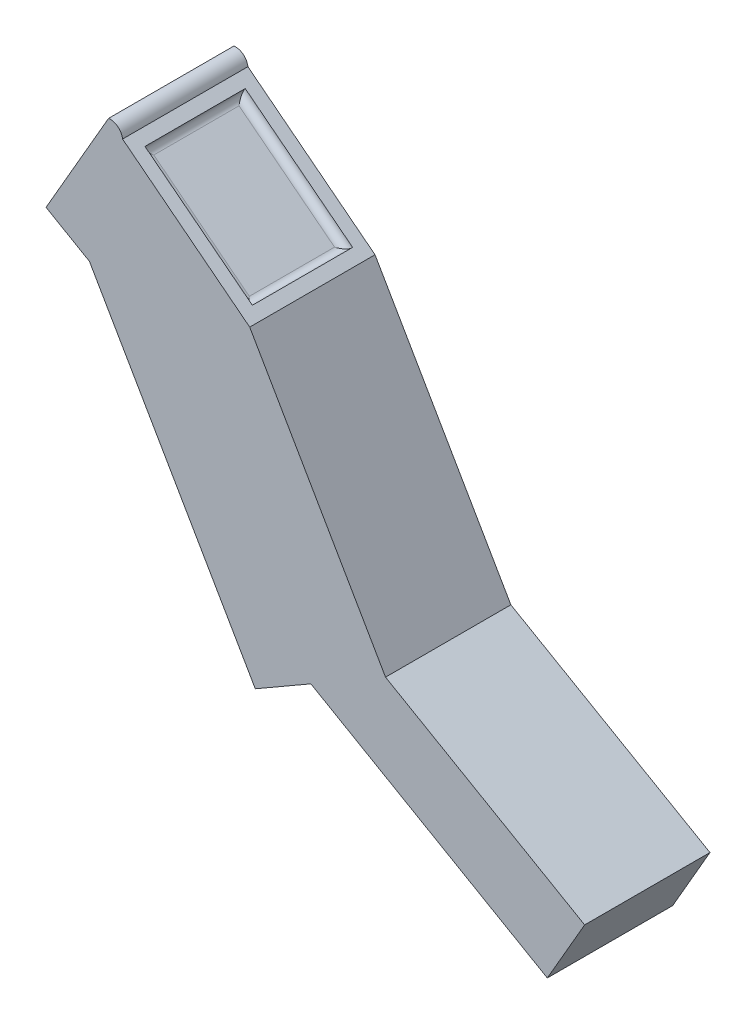
ISO-10303-21;
HEADER;
FILE_DESCRIPTION(('STEP AP214'),'2;1');
FILE_NAME('part.step','',(''),(''),'','','');
FILE_SCHEMA(('AUTOMOTIVE_DESIGN { 1 0 10303 214 1 1 1 1 }'));
ENDSEC;
DATA;
#1=APPLICATION_CONTEXT('core data for automotive mechanical design processes');
#2=APPLICATION_PROTOCOL_DEFINITION('international standard','automotive_design',2000,#1);
#3=PRODUCT_CONTEXT('',#1,'mechanical');
#4=PRODUCT('Part','Part','',(#3));
#5=PRODUCT_RELATED_PRODUCT_CATEGORY('part','',(#4));
#6=PRODUCT_DEFINITION_FORMATION('','',#4);
#7=PRODUCT_DEFINITION_CONTEXT('part definition',#1,'design');
#8=PRODUCT_DEFINITION('design','',#6,#7);
#9=PRODUCT_DEFINITION_SHAPE('','',#8);
#10=(LENGTH_UNIT() NAMED_UNIT(*) SI_UNIT(.MILLI.,.METRE.));
#11=(NAMED_UNIT(*) PLANE_ANGLE_UNIT() SI_UNIT($,.RADIAN.));
#12=(NAMED_UNIT(*) SI_UNIT($,.STERADIAN.) SOLID_ANGLE_UNIT());
#13=UNCERTAINTY_MEASURE_WITH_UNIT(LENGTH_MEASURE(1.E-05),#10,'distance_accuracy_value','');
#14=(GEOMETRIC_REPRESENTATION_CONTEXT(3) GLOBAL_UNCERTAINTY_ASSIGNED_CONTEXT((#13)) GLOBAL_UNIT_ASSIGNED_CONTEXT((#10,
#11,#12)) REPRESENTATION_CONTEXT('',''));
#15=CARTESIAN_POINT('',(0.,0.,0.));
#16=DIRECTION('',(0.,0.,1.));
#17=DIRECTION('',(1.,0.,0.));
#18=AXIS2_PLACEMENT_3D('',#15,#16,#17);
#19=CARTESIAN_POINT('',(-3.57058150505291,1.62403683269044,5.));
#20=DIRECTION('',(0.,0.,-1.));
#21=DIRECTION('',(-1.,0.,0.));
#22=AXIS2_PLACEMENT_3D('',#19,#20,#21);
#23=CYLINDRICAL_SURFACE('',#22,0.500787582760858);
#24=CARTESIAN_POINT('',(-3.57058150505291,1.62403683269044,0.));
#25=DIRECTION('',(0.,0.,1.));
#26=DIRECTION('',(-1.,0.,0.));
#27=AXIS2_PLACEMENT_3D('',#24,#25,#26);
#28=CIRCLE('',#27,0.500787582760858);
#29=CARTESIAN_POINT('',(-3.07354024797554,1.68517758677815,0.));
#30=VERTEX_POINT('',#29);
#31=CARTESIAN_POINT('',(-3.63172225914062,2.1210780897678,0.));
#32=VERTEX_POINT('',#31);
#33=EDGE_CURVE('E183',#30,#32,#28,.T.);
#34=ORIENTED_EDGE('',*,*,#33,.T.);
#35=DIRECTION('',(0.,0.,-1.));
#36=VECTOR('',#35,1.);
#37=CARTESIAN_POINT('',(-3.63172225914062,2.1210780897678,5.));
#38=LINE('',#37,#36);
#39=CARTESIAN_POINT('',(-3.63172225914062,2.1210780897678,5.));
#40=VERTEX_POINT('',#39);
#41=EDGE_CURVE('E250',#40,#32,#38,.T.);
#42=ORIENTED_EDGE('',*,*,#41,.F.);
#43=CARTESIAN_POINT('',(-3.57058150505291,1.62403683269044,5.));
#44=DIRECTION('',(0.,0.,1.));
#45=DIRECTION('',(-1.,0.,0.));
#46=AXIS2_PLACEMENT_3D('',#43,#44,#45);
#47=CIRCLE('',#46,0.500787582760858);
#48=CARTESIAN_POINT('',(-3.07354024797554,1.68517758677815,5.));
#49=VERTEX_POINT('',#48);
#50=EDGE_CURVE('E184',#49,#40,#47,.T.);
#51=ORIENTED_EDGE('',*,*,#50,.F.);
#52=DIRECTION('',(0.,0.,-1.));
#53=VECTOR('',#52,1.);
#54=CARTESIAN_POINT('',(-3.07354024797554,1.68517758677815,5.));
#55=LINE('',#54,#53);
#56=EDGE_CURVE('E222',#49,#30,#55,.T.);
#57=ORIENTED_EDGE('',*,*,#56,.T.);
#58=EDGE_LOOP('',(#34,#42,#51,#57));
#59=FACE_BOUND('',#58,.T.);
#60=ADVANCED_FACE('F34',(#59),#23,.T.);
#61=CARTESIAN_POINT('',(-6.12718022632611,-2.20118189755004,5.));
#62=DIRECTION('',(0.86602540378444,-0.499999999999998,0.));
#63=DIRECTION('',(0.499999999999998,0.86602540378444,0.));
#64=AXIS2_PLACEMENT_3D('',#61,#62,#63);
#65=PLANE('',#64);
#66=DIRECTION('',(-0.499999999999998,-0.86602540378444,0.));
#67=VECTOR('',#66,1.);
#68=CARTESIAN_POINT('',(-6.12718022632611,-2.20118189755004,0.));
#69=LINE('',#68,#67);
#70=CARTESIAN_POINT('',(-6.12718022632611,-2.20118189755004,0.));
#71=VERTEX_POINT('',#70);
#72=EDGE_CURVE('E229',#32,#71,#69,.T.);
#73=ORIENTED_EDGE('',*,*,#72,.T.);
#74=DIRECTION('',(0.,0.,-1.));
#75=VECTOR('',#74,1.);
#76=CARTESIAN_POINT('',(-6.12718022632611,-2.20118189755004,5.));
#77=LINE('',#76,#75);
#78=CARTESIAN_POINT('',(-6.12718022632611,-2.20118189755004,5.));
#79=VERTEX_POINT('',#78);
#80=EDGE_CURVE('E247',#79,#71,#77,.T.);
#81=ORIENTED_EDGE('',*,*,#80,.F.);
#82=DIRECTION('',(-0.499999999999998,-0.86602540378444,0.));
#83=VECTOR('',#82,1.);
#84=CARTESIAN_POINT('',(-6.12718022632611,-2.20118189755004,5.));
#85=LINE('',#84,#83);
#86=EDGE_CURVE('E187',#40,#79,#85,.T.);
#87=ORIENTED_EDGE('',*,*,#86,.F.);
#88=ORIENTED_EDGE('',*,*,#41,.T.);
#89=EDGE_LOOP('',(#73,#81,#87,#88));
#90=FACE_BOUND('',#89,.T.);
#91=ADVANCED_FACE('F292',(#90),#65,.F.);
#92=CARTESIAN_POINT('',(-4.39512941875723,-3.20118189755004,5.));
#93=DIRECTION('',(0.499999999999999,0.86602540378444,0.));
#94=DIRECTION('',(-0.86602540378444,0.499999999999999,0.));
#95=AXIS2_PLACEMENT_3D('',#92,#93,#94);
#96=PLANE('',#95);
#97=DIRECTION('',(0.86602540378444,-0.499999999999999,0.));
#98=VECTOR('',#97,1.);
#99=CARTESIAN_POINT('',(-4.39512941875723,-3.20118189755004,0.));
#100=LINE('',#99,#98);
#101=CARTESIAN_POINT('',(-4.39512941875723,-3.20118189755004,0.));
#102=VERTEX_POINT('',#101);
#103=EDGE_CURVE('E231',#71,#102,#100,.T.);
#104=ORIENTED_EDGE('',*,*,#103,.T.);
#105=DIRECTION('',(0.,0.,-1.));
#106=VECTOR('',#105,1.);
#107=CARTESIAN_POINT('',(-4.39512941875723,-3.20118189755004,5.));
#108=LINE('',#107,#106);
#109=CARTESIAN_POINT('',(-4.39512941875723,-3.20118189755004,5.));
#110=VERTEX_POINT('',#109);
#111=EDGE_CURVE('E244',#110,#102,#108,.T.);
#112=ORIENTED_EDGE('',*,*,#111,.F.);
#113=DIRECTION('',(0.86602540378444,-0.499999999999999,0.));
#114=VECTOR('',#113,1.);
#115=CARTESIAN_POINT('',(-4.39512941875723,-3.20118189755004,5.));
#116=LINE('',#115,#114);
#117=EDGE_CURVE('E190',#79,#110,#116,.T.);
#118=ORIENTED_EDGE('',*,*,#117,.F.);
#119=ORIENTED_EDGE('',*,*,#80,.T.);
#120=EDGE_LOOP('',(#104,#112,#118,#119));
#121=FACE_BOUND('',#120,.T.);
#122=ADVANCED_FACE('F298',(#121),#96,.F.);
#123=CARTESIAN_POINT('',(2.22192139124275,-14.6622500967348,5.));
#124=DIRECTION('',(0.866025403784439,0.499999999999999,0.));
#125=DIRECTION('',(-0.499999999999999,0.866025403784439,0.));
#126=AXIS2_PLACEMENT_3D('',#123,#124,#125);
#127=PLANE('',#126);
#128=DIRECTION('',(0.499999999999999,-0.866025403784439,0.));
#129=VECTOR('',#128,1.);
#130=CARTESIAN_POINT('',(2.22192139124275,-14.6622500967348,0.));
#131=LINE('',#130,#129);
#132=CARTESIAN_POINT('',(2.22192139124275,-14.6622500967348,0.));
#133=VERTEX_POINT('',#132);
#134=EDGE_CURVE('E233',#102,#133,#131,.T.);
#135=ORIENTED_EDGE('',*,*,#134,.T.);
#136=DIRECTION('',(0.,0.,-1.));
#137=VECTOR('',#136,1.);
#138=CARTESIAN_POINT('',(2.22192139124275,-14.6622500967348,5.));
#139=LINE('',#138,#137);
#140=CARTESIAN_POINT('',(2.22192139124275,-14.6622500967348,5.));
#141=VERTEX_POINT('',#140);
#142=EDGE_CURVE('E241',#141,#133,#139,.T.);
#143=ORIENTED_EDGE('',*,*,#142,.F.);
#144=DIRECTION('',(0.499999999999999,-0.866025403784439,0.));
#145=VECTOR('',#144,1.);
#146=CARTESIAN_POINT('',(2.22192139124275,-14.6622500967348,5.));
#147=LINE('',#146,#145);
#148=EDGE_CURVE('E192',#110,#141,#147,.T.);
#149=ORIENTED_EDGE('',*,*,#148,.F.);
#150=ORIENTED_EDGE('',*,*,#111,.T.);
#151=EDGE_LOOP('',(#135,#143,#149,#150));
#152=FACE_BOUND('',#151,.T.);
#153=ADVANCED_FACE('F388',(#152),#127,.F.);
#154=CARTESIAN_POINT('',(2.22192139124275,-14.6622500967348,5.));
#155=DIRECTION('',(-0.5,0.866025403784438,0.));
#156=DIRECTION('',(-0.866025403784438,-0.5,0.));
#157=AXIS2_PLACEMENT_3D('',#154,#155,#156);
#158=PLANE('',#157);
#159=DIRECTION('',(0.866025403784438,0.5,0.));
#160=VECTOR('',#159,1.);
#161=CARTESIAN_POINT('',(2.22192139124275,-14.6622500967348,0.));
#162=LINE('',#161,#160);
#163=CARTESIAN_POINT('',(4.43894642493093,-13.3822500967348,0.));
#164=VERTEX_POINT('',#163);
#165=EDGE_CURVE('E202',#133,#164,#162,.T.);
#166=ORIENTED_EDGE('',*,*,#165,.T.);
#167=DIRECTION('',(0.,0.,1.));
#168=VECTOR('',#167,1.);
#169=CARTESIAN_POINT('',(4.43894642493093,-13.3822500967348,-13.0642177387711));
#170=LINE('',#169,#168);
#171=CARTESIAN_POINT('',(4.43894642493093,-13.3822500967348,5.));
#172=VERTEX_POINT('',#171);
#173=EDGE_CURVE('E156',#164,#172,#170,.T.);
#174=ORIENTED_EDGE('',*,*,#173,.T.);
#175=DIRECTION('',(0.866025403784438,0.5,0.));
#176=VECTOR('',#175,1.);
#177=CARTESIAN_POINT('',(2.22192139124275,-14.6622500967348,5.));
#178=LINE('',#177,#176);
#179=EDGE_CURVE('E194',#141,#172,#178,.T.);
#180=ORIENTED_EDGE('',*,*,#179,.F.);
#181=ORIENTED_EDGE('',*,*,#142,.T.);
#182=EDGE_LOOP('',(#166,#174,#180,#181));
#183=FACE_BOUND('',#182,.T.);
#184=ADVANCED_FACE('F393',(#183),#158,.F.);
#185=CARTESIAN_POINT('',(1.99897594712462,-2.27609726020619,5.));
#186=DIRECTION('',(-0.866025403784438,-0.5,0.));
#187=DIRECTION('',(0.5,-0.866025403784438,0.));
#188=AXIS2_PLACEMENT_3D('',#185,#186,#187);
#189=PLANE('',#188);
#190=DIRECTION('',(-0.5,0.866025403784438,0.));
#191=VECTOR('',#190,1.);
#192=CARTESIAN_POINT('',(1.99897594712462,-2.27609726020619,0.));
#193=LINE('',#192,#191);
#194=CARTESIAN_POINT('',(7.4180738139494,-11.6622500967348,0.));
#195=VERTEX_POINT('',#194);
#196=CARTESIAN_POINT('',(1.99897594712462,-2.27609726020619,0.));
#197=VERTEX_POINT('',#196);
#198=EDGE_CURVE('E236',#195,#197,#193,.T.);
#199=ORIENTED_EDGE('',*,*,#198,.T.);
#200=DIRECTION('',(0.,0.,-1.));
#201=VECTOR('',#200,1.);
#202=CARTESIAN_POINT('',(1.99897594712462,-2.27609726020619,5.));
#203=LINE('',#202,#201);
#204=CARTESIAN_POINT('',(1.99897594712462,-2.27609726020619,5.));
#205=VERTEX_POINT('',#204);
#206=EDGE_CURVE('E219',#205,#197,#203,.T.);
#207=ORIENTED_EDGE('',*,*,#206,.F.);
#208=DIRECTION('',(-0.499999999999999,0.866025403784439,0.));
#209=VECTOR('',#208,1.);
#210=CARTESIAN_POINT('',(6.28837327212462,-9.70555136095622,5.));
#211=LINE('',#210,#209);
#212=CARTESIAN_POINT('',(7.4180738139494,-11.6622500967348,5.));
#213=VERTEX_POINT('',#212);
#214=EDGE_CURVE('E197',#213,#205,#211,.T.);
#215=ORIENTED_EDGE('',*,*,#214,.F.);
#216=DIRECTION('',(0.,0.,-1.));
#217=VECTOR('',#216,1.);
#218=CARTESIAN_POINT('',(7.4180738139494,-11.6622500967348,5.));
#219=LINE('',#218,#217);
#220=EDGE_CURVE('E212',#213,#195,#219,.T.);
#221=ORIENTED_EDGE('',*,*,#220,.T.);
#222=EDGE_LOOP('',(#199,#207,#215,#221));
#223=FACE_BOUND('',#222,.T.);
#224=ADVANCED_FACE('F217',(#223),#189,.F.);
#225=CARTESIAN_POINT('',(1.99897594712462,-2.27609726020619,5.));
#226=DIRECTION('',(-0.615486909414452,-0.788147108311289,0.));
#227=DIRECTION('',(0.788147108311289,-0.615486909414452,0.));
#228=AXIS2_PLACEMENT_3D('',#225,#226,#227);
#229=PLANE('',#228);
#230=DIRECTION('',(0.,0.,-1.));
#231=VECTOR('',#230,1.);
#232=CARTESIAN_POINT('',(1.60490239296898,-1.96835380549897,4.5));
#233=LINE('',#232,#231);
#234=CARTESIAN_POINT('',(1.60490239296898,-1.96835380549897,4.5));
#235=VERTEX_POINT('',#234);
#236=CARTESIAN_POINT('',(1.60490239296898,-1.96835380549897,0.5));
#237=VERTEX_POINT('',#236);
#238=EDGE_CURVE('E173',#235,#237,#233,.T.);
#239=ORIENTED_EDGE('',*,*,#238,.F.);
#240=DIRECTION('',(0.788147108311289,-0.615486909414452,0.));
#241=VECTOR('',#240,1.);
#242=CARTESIAN_POINT('',(-2.6794666938199,1.37743413207092,4.5));
#243=LINE('',#242,#241);
#244=CARTESIAN_POINT('',(-2.6794666938199,1.37743413207092,4.5));
#245=VERTEX_POINT('',#244);
#246=EDGE_CURVE('E170',#245,#235,#243,.T.);
#247=ORIENTED_EDGE('',*,*,#246,.F.);
#248=DIRECTION('',(0.,0.,1.));
#249=VECTOR('',#248,1.);
#250=CARTESIAN_POINT('',(-2.6794666938199,1.37743413207092,0.500000000000001));
#251=LINE('',#250,#249);
#252=CARTESIAN_POINT('',(-2.6794666938199,1.37743413207092,0.500000000000001));
#253=VERTEX_POINT('',#252);
#254=EDGE_CURVE('E180',#253,#245,#251,.T.);
#255=ORIENTED_EDGE('',*,*,#254,.F.);
#256=DIRECTION('',(-0.788147108311289,0.615486909414452,0.));
#257=VECTOR('',#256,1.);
#258=CARTESIAN_POINT('',(1.60490239296898,-1.96835380549897,0.5));
#259=LINE('',#258,#257);
#260=EDGE_CURVE('E177',#237,#253,#259,.T.);
#261=ORIENTED_EDGE('',*,*,#260,.F.);
#262=EDGE_LOOP('',(#239,#247,#255,#261));
#263=FACE_BOUND('',#262,.T.);
#264=DIRECTION('',(-0.788147108311289,0.615486909414452,0.));
#265=VECTOR('',#264,1.);
#266=CARTESIAN_POINT('',(1.99897594712462,-2.27609726020619,0.));
#267=LINE('',#266,#265);
#268=EDGE_CURVE('E188',#197,#30,#267,.T.);
#269=ORIENTED_EDGE('',*,*,#268,.T.);
#270=ORIENTED_EDGE('',*,*,#56,.F.);
#271=DIRECTION('',(-0.788147108311289,0.615486909414452,0.));
#272=VECTOR('',#271,1.);
#273=CARTESIAN_POINT('',(1.99897594712462,-2.27609726020619,5.));
#274=LINE('',#273,#272);
#275=EDGE_CURVE('E221',#205,#49,#274,.T.);
#276=ORIENTED_EDGE('',*,*,#275,.F.);
#277=ORIENTED_EDGE('',*,*,#206,.T.);
#278=EDGE_LOOP('',(#269,#270,#276,#277));
#279=FACE_BOUND('',#278,.T.);
#280=ADVANCED_FACE('F272',(#263,#279),#229,.F.);
#281=CARTESIAN_POINT('',(-3.57058150505291,1.62403683269044,5.));
#282=DIRECTION('',(0.,0.,-1.));
#283=DIRECTION('',(-1.,0.,0.));
#284=AXIS2_PLACEMENT_3D('',#281,#282,#283);
#285=PLANE('',#284);
#286=ORIENTED_EDGE('',*,*,#50,.T.);
#287=ORIENTED_EDGE('',*,*,#86,.T.);
#288=ORIENTED_EDGE('',*,*,#117,.T.);
#289=ORIENTED_EDGE('',*,*,#148,.T.);
#290=ORIENTED_EDGE('',*,*,#179,.T.);
#291=DIRECTION('',(0.866025403784439,-0.5,0.));
#292=VECTOR('',#291,1.);
#293=CARTESIAN_POINT('',(4.43894642493093,-13.3822500967348,5.));
#294=LINE('',#293,#292);
#295=CARTESIAN_POINT('',(13.8725357885828,-18.8287354552636,5.));
#296=VERTEX_POINT('',#295);
#297=EDGE_CURVE('E51',#172,#296,#294,.T.);
#298=ORIENTED_EDGE('',*,*,#297,.T.);
#299=DIRECTION('',(0.499999999999999,0.866025403784439,0.));
#300=VECTOR('',#299,1.);
#301=CARTESIAN_POINT('',(13.8725357885828,-18.8287354552636,5.));
#302=LINE('',#301,#300);
#303=CARTESIAN_POINT('',(15.362099483092,-16.2487354552636,5.));
#304=VERTEX_POINT('',#303);
#305=EDGE_CURVE('E153',#296,#304,#302,.T.);
#306=ORIENTED_EDGE('',*,*,#305,.T.);
#307=DIRECTION('',(-0.866025403784439,0.5,0.));
#308=VECTOR('',#307,1.);
#309=CARTESIAN_POINT('',(7.4180738139494,-11.6622500967348,5.));
#310=LINE('',#309,#308);
#311=EDGE_CURVE('E158',#304,#213,#310,.T.);
#312=ORIENTED_EDGE('',*,*,#311,.T.);
#313=ORIENTED_EDGE('',*,*,#214,.T.);
#314=ORIENTED_EDGE('',*,*,#275,.T.);
#315=EDGE_LOOP('',(#286,#287,#288,#289,#290,#298,#306,#312,#313,#314));
#316=FACE_BOUND('',#315,.T.);
#317=ADVANCED_FACE('F214',(#316),#285,.F.);
#318=CARTESIAN_POINT('',(-3.57058150505291,1.62403683269044,0.));
#319=DIRECTION('',(0.,0.,-1.));
#320=DIRECTION('',(-1.,0.,0.));
#321=AXIS2_PLACEMENT_3D('',#318,#319,#320);
#322=PLANE('',#321);
#323=ORIENTED_EDGE('',*,*,#33,.F.);
#324=ORIENTED_EDGE('',*,*,#268,.F.);
#325=ORIENTED_EDGE('',*,*,#198,.F.);
#326=DIRECTION('',(-0.866025403784439,0.5,0.));
#327=VECTOR('',#326,1.);
#328=CARTESIAN_POINT('',(7.4180738139494,-11.6622500967348,0.));
#329=LINE('',#328,#327);
#330=CARTESIAN_POINT('',(15.362099483092,-16.2487354552636,0.));
#331=VERTEX_POINT('',#330);
#332=EDGE_CURVE('E144',#331,#195,#329,.T.);
#333=ORIENTED_EDGE('',*,*,#332,.F.);
#334=DIRECTION('',(0.499999999999999,0.866025403784439,0.));
#335=VECTOR('',#334,1.);
#336=CARTESIAN_POINT('',(13.8725357885828,-18.8287354552636,0.));
#337=LINE('',#336,#335);
#338=CARTESIAN_POINT('',(13.8725357885828,-18.8287354552636,0.));
#339=VERTEX_POINT('',#338);
#340=EDGE_CURVE('E136',#339,#331,#337,.T.);
#341=ORIENTED_EDGE('',*,*,#340,.F.);
#342=DIRECTION('',(0.866025403784439,-0.5,0.));
#343=VECTOR('',#342,1.);
#344=CARTESIAN_POINT('',(4.43894642493093,-13.3822500967348,0.));
#345=LINE('',#344,#343);
#346=EDGE_CURVE('E142',#164,#339,#345,.T.);
#347=ORIENTED_EDGE('',*,*,#346,.F.);
#348=ORIENTED_EDGE('',*,*,#165,.F.);
#349=ORIENTED_EDGE('',*,*,#134,.F.);
#350=ORIENTED_EDGE('',*,*,#103,.F.);
#351=ORIENTED_EDGE('',*,*,#72,.F.);
#352=EDGE_LOOP('',(#323,#324,#325,#333,#341,#347,#348,#349,#350,#351));
#353=FACE_BOUND('',#352,.T.);
#354=ADVANCED_FACE('F139',(#353),#322,.T.);
#355=CARTESIAN_POINT('',(-0.531507380419078,-0.68060912184458,0.));
#356=DIRECTION('',(0.615486909414452,0.788147108311289,0.));
#357=DIRECTION('',(-0.788147108311289,0.615486909414452,0.));
#358=AXIS2_PLACEMENT_3D('',#355,#356,#357);
#359=PLANE('',#358);
#360=DIRECTION('',(-0.788147108311289,0.615486909414452,0.));
#361=VECTOR('',#360,1.);
#362=CARTESIAN_POINT('',(-0.531507380419078,-0.68060912184458,0.8));
#363=LINE('',#362,#361);
#364=CARTESIAN_POINT('',(1.18381218765125,-2.02015186516802,0.8));
#365=VERTEX_POINT('',#364);
#366=CARTESIAN_POINT('',(-2.62766863415085,0.956343926753201,0.800000000000001));
#367=VERTEX_POINT('',#366);
#368=EDGE_CURVE('E43',#365,#367,#363,.T.);
#369=ORIENTED_EDGE('',*,*,#368,.T.);
#370=DIRECTION('',(0.,0.,1.));
#371=VECTOR('',#370,1.);
#372=CARTESIAN_POINT('',(-2.62766863415085,0.956343926753201,0.));
#373=LINE('',#372,#371);
#374=CARTESIAN_POINT('',(-2.62766863415085,0.9563439267532,4.2));
#375=VERTEX_POINT('',#374);
#376=EDGE_CURVE('E11',#367,#375,#373,.T.);
#377=ORIENTED_EDGE('',*,*,#376,.T.);
#378=DIRECTION('',(0.788147108311289,-0.615486909414452,0.));
#379=VECTOR('',#378,1.);
#380=CARTESIAN_POINT('',(-0.531507380419078,-0.68060912184458,4.2));
#381=LINE('',#380,#379);
#382=CARTESIAN_POINT('',(1.18381218765125,-2.02015186516802,4.2));
#383=VERTEX_POINT('',#382);
#384=EDGE_CURVE('E253',#375,#383,#381,.T.);
#385=ORIENTED_EDGE('',*,*,#384,.T.);
#386=DIRECTION('',(0.,0.,-1.));
#387=VECTOR('',#386,1.);
#388=CARTESIAN_POINT('',(1.18381218765125,-2.02015186516802,0.));
#389=LINE('',#388,#387);
#390=EDGE_CURVE('E255',#383,#365,#389,.T.);
#391=ORIENTED_EDGE('',*,*,#390,.T.);
#392=EDGE_LOOP('',(#369,#377,#385,#391));
#393=FACE_BOUND('',#392,.T.);
#394=ADVANCED_FACE('F281',(#393),#359,.T.);
#395=CARTESIAN_POINT('',(1.36845826047559,-1.78370773267463,0.));
#396=DIRECTION('',(0.,0.,-1.));
#397=DIRECTION('',(-1.,0.,0.));
#398=AXIS2_PLACEMENT_3D('',#395,#396,#397);
#399=CYLINDRICAL_SURFACE('',#398,0.3);
#400=CARTESIAN_POINT('',(1.36845826047559,-1.78370773267463,4.2));
#401=DIRECTION('',(0.557304164859481,-0.435214967378509,-0.707106781186547));
#402=DIRECTION('',(-0.557304164859481,0.435214967378509,-0.707106781186547));
#403=AXIS2_PLACEMENT_3D('',#400,#401,#402);
#404=ELLIPSE('',#403,0.424264068711928,0.3);
#405=EDGE_CURVE('E261',#235,#383,#404,.T.);
#406=ORIENTED_EDGE('',*,*,#405,.F.);
#407=ORIENTED_EDGE('',*,*,#238,.T.);
#408=CARTESIAN_POINT('',(1.36845826047559,-1.78370773267463,0.8));
#409=DIRECTION('',(-0.557304164859481,0.435214967378509,-0.707106781186547));
#410=DIRECTION('',(-0.557304164859481,0.435214967378509,0.707106781186547));
#411=AXIS2_PLACEMENT_3D('',#408,#409,#410);
#412=ELLIPSE('',#411,0.424264068711929,0.3);
#413=EDGE_CURVE('E174',#365,#237,#412,.F.);
#414=ORIENTED_EDGE('',*,*,#413,.F.);
#415=ORIENTED_EDGE('',*,*,#390,.F.);
#416=EDGE_LOOP('',(#406,#407,#414,#415));
#417=FACE_BOUND('',#416,.T.);
#418=ADVANCED_FACE('F36',(#417),#399,.F.);
#419=CARTESIAN_POINT('',(-0.346861307594742,-0.444164989351193,0.8));
#420=DIRECTION('',(-0.788147108311289,0.615486909414452,0.));
#421=DIRECTION('',(-0.615486909414452,-0.788147108311289,0.));
#422=AXIS2_PLACEMENT_3D('',#419,#420,#421);
#423=CYLINDRICAL_SURFACE('',#422,0.3);
#424=ORIENTED_EDGE('',*,*,#413,.T.);
#425=ORIENTED_EDGE('',*,*,#260,.T.);
#426=CARTESIAN_POINT('',(-2.44302256132651,1.19278805924659,0.800000000000001));
#427=DIRECTION('',(-0.557304164859481,0.435214967378509,0.707106781186548));
#428=DIRECTION('',(0.557304164859481,-0.435214967378509,0.707106781186547));
#429=AXIS2_PLACEMENT_3D('',#426,#427,#428);
#430=ELLIPSE('',#429,0.424264068711929,0.3);
#431=EDGE_CURVE('E259',#367,#253,#430,.F.);
#432=ORIENTED_EDGE('',*,*,#431,.F.);
#433=ORIENTED_EDGE('',*,*,#368,.F.);
#434=EDGE_LOOP('',(#424,#425,#432,#433));
#435=FACE_BOUND('',#434,.T.);
#436=ADVANCED_FACE('F266',(#435),#423,.F.);
#437=CARTESIAN_POINT('',(-0.346861307594743,-0.444164989351193,4.2));
#438=DIRECTION('',(0.788147108311289,-0.615486909414452,0.));
#439=DIRECTION('',(0.615486909414452,0.788147108311289,0.));
#440=AXIS2_PLACEMENT_3D('',#437,#438,#439);
#441=CYLINDRICAL_SURFACE('',#440,0.3);
#442=ORIENTED_EDGE('',*,*,#405,.T.);
#443=ORIENTED_EDGE('',*,*,#384,.F.);
#444=CARTESIAN_POINT('',(-2.44302256132651,1.19278805924659,4.2));
#445=DIRECTION('',(0.557304164859481,-0.435214967378509,0.707106781186547));
#446=DIRECTION('',(-0.557304164859481,0.435214967378509,0.707106781186548));
#447=AXIS2_PLACEMENT_3D('',#444,#445,#446);
#448=ELLIPSE('',#447,0.424264068711928,0.3);
#449=EDGE_CURVE('E164',#245,#375,#448,.T.);
#450=ORIENTED_EDGE('',*,*,#449,.F.);
#451=ORIENTED_EDGE('',*,*,#246,.T.);
#452=EDGE_LOOP('',(#442,#443,#450,#451));
#453=FACE_BOUND('',#452,.T.);
#454=ADVANCED_FACE('F280',(#453),#441,.F.);
#455=CARTESIAN_POINT('',(-2.44302256132651,1.19278805924659,0.));
#456=DIRECTION('',(0.,0.,1.));
#457=DIRECTION('',(1.,0.,0.));
#458=AXIS2_PLACEMENT_3D('',#455,#456,#457);
#459=CYLINDRICAL_SURFACE('',#458,0.3);
#460=ORIENTED_EDGE('',*,*,#431,.T.);
#461=ORIENTED_EDGE('',*,*,#254,.T.);
#462=ORIENTED_EDGE('',*,*,#449,.T.);
#463=ORIENTED_EDGE('',*,*,#376,.F.);
#464=EDGE_LOOP('',(#460,#461,#462,#463));
#465=FACE_BOUND('',#464,.T.);
#466=ADVANCED_FACE('F276',(#465),#459,.F.);
#467=CARTESIAN_POINT('',(4.43894642493093,-13.3822500967348,-13.0642177387711));
#468=DIRECTION('',(-0.5,-0.866025403784439,0.));
#469=DIRECTION('',(0.866025403784439,-0.5,0.));
#470=AXIS2_PLACEMENT_3D('',#467,#468,#469);
#471=PLANE('',#470);
#472=ORIENTED_EDGE('',*,*,#173,.F.);
#473=ORIENTED_EDGE('',*,*,#346,.T.);
#474=DIRECTION('',(0.,0.,1.));
#475=VECTOR('',#474,1.);
#476=CARTESIAN_POINT('',(13.8725357885828,-18.8287354552636,-13.0642177387711));
#477=LINE('',#476,#475);
#478=EDGE_CURVE('E148',#339,#296,#477,.T.);
#479=ORIENTED_EDGE('',*,*,#478,.T.);
#480=ORIENTED_EDGE('',*,*,#297,.F.);
#481=EDGE_LOOP('',(#472,#473,#479,#480));
#482=FACE_BOUND('',#481,.T.);
#483=ADVANCED_FACE('F155',(#482),#471,.T.);
#484=CARTESIAN_POINT('',(13.8725357885828,-18.8287354552636,-13.0642177387711));
#485=DIRECTION('',(0.866025403784439,-0.499999999999999,0.));
#486=DIRECTION('',(0.499999999999999,0.866025403784439,0.));
#487=AXIS2_PLACEMENT_3D('',#484,#485,#486);
#488=PLANE('',#487);
#489=ORIENTED_EDGE('',*,*,#478,.F.);
#490=ORIENTED_EDGE('',*,*,#340,.T.);
#491=DIRECTION('',(0.,0.,1.));
#492=VECTOR('',#491,1.);
#493=CARTESIAN_POINT('',(15.362099483092,-16.2487354552636,-13.0642177387711));
#494=LINE('',#493,#492);
#495=EDGE_CURVE('E147',#331,#304,#494,.T.);
#496=ORIENTED_EDGE('',*,*,#495,.T.);
#497=ORIENTED_EDGE('',*,*,#305,.F.);
#498=EDGE_LOOP('',(#489,#490,#496,#497));
#499=FACE_BOUND('',#498,.T.);
#500=ADVANCED_FACE('F151',(#499),#488,.T.);
#501=CARTESIAN_POINT('',(7.4180738139494,-11.6622500967348,-13.0642177387711));
#502=DIRECTION('',(0.5,0.866025403784439,0.));
#503=DIRECTION('',(-0.866025403784439,0.5,0.));
#504=AXIS2_PLACEMENT_3D('',#501,#502,#503);
#505=PLANE('',#504);
#506=ORIENTED_EDGE('',*,*,#495,.F.);
#507=ORIENTED_EDGE('',*,*,#332,.T.);
#508=ORIENTED_EDGE('',*,*,#220,.F.);
#509=ORIENTED_EDGE('',*,*,#311,.F.);
#510=EDGE_LOOP('',(#506,#507,#508,#509));
#511=FACE_BOUND('',#510,.T.);
#512=ADVANCED_FACE('F210',(#511),#505,.T.);
#513=CLOSED_SHELL('',(#60,#91,#122,#153,#184,#224,#280,#317,#354,#394,#418,#436,#454,#466,#483,
#500,#512));
#514=MANIFOLD_SOLID_BREP('B2',#513);
#515=ADVANCED_BREP_SHAPE_REPRESENTATION('',(#18,#514),#14);
#516=SHAPE_DEFINITION_REPRESENTATION(#9,#515);
ENDSEC;
END-ISO-10303-21;
